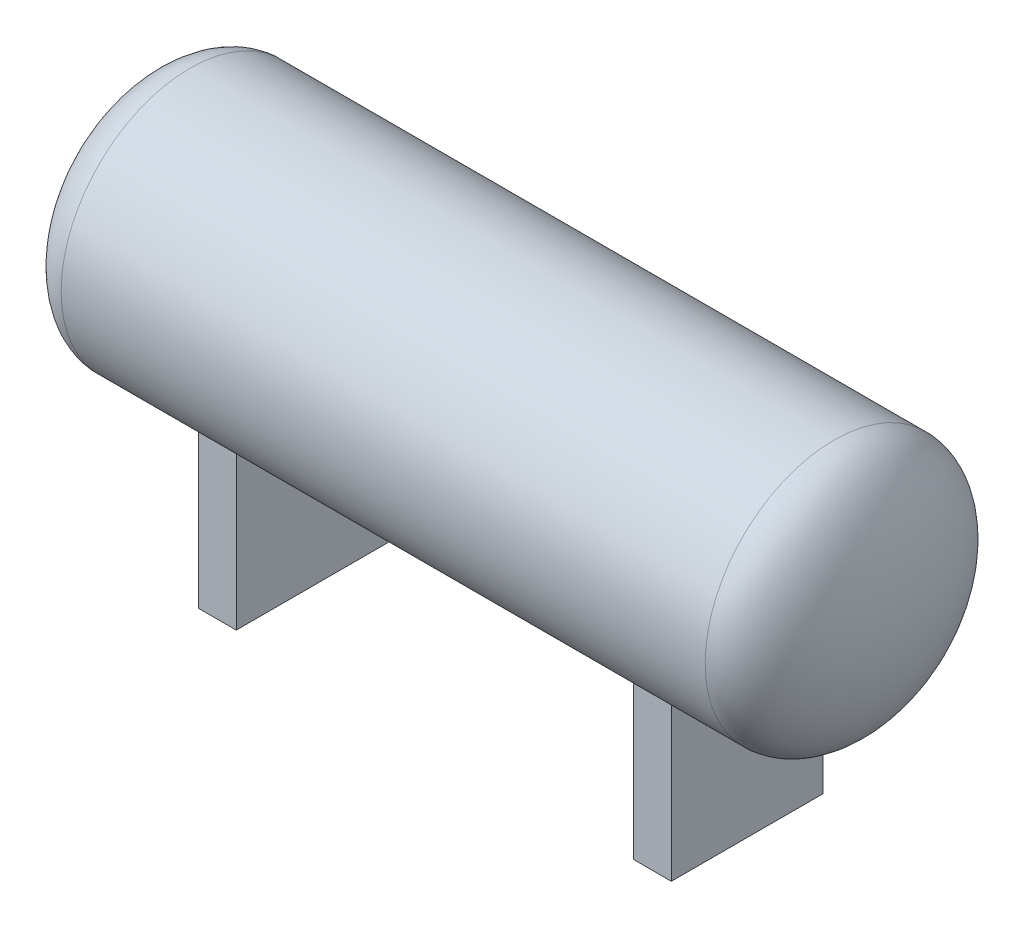
ISO-10303-21;
HEADER;
FILE_DESCRIPTION(('STEP AP214'),'2;1');
FILE_NAME('part.step','',(''),(''),'','','');
FILE_SCHEMA(('AUTOMOTIVE_DESIGN { 1 0 10303 214 1 1 1 1 }'));
ENDSEC;
DATA;
#1=APPLICATION_CONTEXT('core data for automotive mechanical design processes');
#2=APPLICATION_PROTOCOL_DEFINITION('international standard','automotive_design',2000,#1);
#3=PRODUCT_CONTEXT('',#1,'mechanical');
#4=PRODUCT('Part','Part','',(#3));
#5=PRODUCT_RELATED_PRODUCT_CATEGORY('part','',(#4));
#6=PRODUCT_DEFINITION_FORMATION('','',#4);
#7=PRODUCT_DEFINITION_CONTEXT('part definition',#1,'design');
#8=PRODUCT_DEFINITION('design','',#6,#7);
#9=PRODUCT_DEFINITION_SHAPE('','',#8);
#10=(LENGTH_UNIT() NAMED_UNIT(*) SI_UNIT(.MILLI.,.METRE.));
#11=(NAMED_UNIT(*) PLANE_ANGLE_UNIT() SI_UNIT($,.RADIAN.));
#12=(NAMED_UNIT(*) SI_UNIT($,.STERADIAN.) SOLID_ANGLE_UNIT());
#13=UNCERTAINTY_MEASURE_WITH_UNIT(LENGTH_MEASURE(1.E-05),#10,'distance_accuracy_value','');
#14=(GEOMETRIC_REPRESENTATION_CONTEXT(3) GLOBAL_UNCERTAINTY_ASSIGNED_CONTEXT((#13)) GLOBAL_UNIT_ASSIGNED_CONTEXT((#10,
#11,#12)) REPRESENTATION_CONTEXT('',''));
#15=CARTESIAN_POINT('',(0.,0.,0.));
#16=DIRECTION('',(0.,0.,1.));
#17=DIRECTION('',(1.,0.,0.));
#18=AXIS2_PLACEMENT_3D('',#15,#16,#17);
#19=CARTESIAN_POINT('',(5000.,8.88178419700125E-13,0.));
#20=DIRECTION('',(0.,0.,-1.));
#21=DIRECTION('',(0.,-1.,0.));
#22=AXIS2_PLACEMENT_3D('',#19,#20,#21);
#23=ELLIPSE('',#22,2000.,1000.);
#24=TRIMMED_CURVE('',#23,(PARAMETER_VALUE(4.71238898038469)),
(PARAMETER_VALUE(7.85398163397448)),.T.,.PARAMETER.);
#25=CARTESIAN_POINT('',(4000.,8.88178419700125E-13,0.));
#26=DIRECTION('',(1.,0.,0.));
#27=AXIS1_PLACEMENT('',#25,#26);
#28=SURFACE_OF_REVOLUTION('',#24,#27);
#29=CARTESIAN_POINT('',(6000.,8.88178419700125E-13,0.));
#30=VERTEX_POINT('',#29);
#31=VERTEX_LOOP('',#30);
#32=FACE_BOUND('',#31,.T.);
#33=CARTESIAN_POINT('',(5000.,8.88178419700125E-13,0.));
#34=DIRECTION('',(-1.,0.,0.));
#35=DIRECTION('',(0.,-1.,0.));
#36=AXIS2_PLACEMENT_3D('',#33,#34,#35);
#37=CIRCLE('',#36,2000.);
#38=CARTESIAN_POINT('',(5000.,-2000.,0.));
#39=VERTEX_POINT('',#38);
#40=EDGE_CURVE('E154',#39,#39,#37,.T.);
#41=ORIENTED_EDGE('',*,*,#40,.F.);
#42=EDGE_LOOP('',(#41));
#43=FACE_BOUND('',#42,.T.);
#44=ADVANCED_FACE('F30',(#32,#43),#28,.F.);
#45=CARTESIAN_POINT('',(-4927.31665531561,-8.88178419700125E-13,0.));
#46=DIRECTION('',(-1.,0.,0.));
#47=DIRECTION('',(0.,-1.,0.));
#48=AXIS2_PLACEMENT_3D('',#45,#46,#47);
#49=CYLINDRICAL_SURFACE('',#48,2000.);
#50=CARTESIAN_POINT('',(-3084.8333836706,0.,0.));
#51=DIRECTION('',(1.,0.,0.));
#52=DIRECTION('',(0.,0.,-1.));
#53=AXIS2_PLACEMENT_3D('',#50,#51,#52);
#54=CIRCLE('',#53,2000.);
#55=CARTESIAN_POINT('',(-3084.8333836706,-1602.56524695724,1196.57203261854));
#56=VERTEX_POINT('',#55);
#57=CARTESIAN_POINT('',(-3084.8333836706,-1631.945015768,-1156.18141548374));
#58=VERTEX_POINT('',#57);
#59=EDGE_CURVE('E39',#56,#58,#54,.T.);
#60=ORIENTED_EDGE('',*,*,#59,.T.);
#61=DIRECTION('',(-1.,0.,0.));
#62=VECTOR('',#61,1.);
#63=CARTESIAN_POINT('',(-4927.31665531561,-1631.945015768,-1156.18141548374));
#64=LINE('',#63,#62);
#65=CARTESIAN_POINT('',(-3670.49733212524,-1631.945015768,-1156.18141548374));
#66=VERTEX_POINT('',#65);
#67=EDGE_CURVE('E11',#58,#66,#64,.T.);
#68=ORIENTED_EDGE('',*,*,#67,.T.);
#69=CARTESIAN_POINT('',(-3670.49733212524,-8.88178419700125E-13,0.));
#70=DIRECTION('',(-1.,0.,0.));
#71=DIRECTION('',(0.,0.,1.));
#72=AXIS2_PLACEMENT_3D('',#69,#70,#71);
#73=CIRCLE('',#72,2000.);
#74=CARTESIAN_POINT('',(-3670.49733212524,-1602.56524695724,1196.57203261854));
#75=VERTEX_POINT('',#74);
#76=EDGE_CURVE('E105',#66,#75,#73,.T.);
#77=ORIENTED_EDGE('',*,*,#76,.T.);
#78=DIRECTION('',(-1.,0.,0.));
#79=VECTOR('',#78,1.);
#80=CARTESIAN_POINT('',(-4927.31665531561,-1602.56524695724,1196.57203261854));
#81=LINE('',#80,#79);
#82=EDGE_CURVE('E288',#75,#56,#81,.F.);
#83=ORIENTED_EDGE('',*,*,#82,.T.);
#84=EDGE_LOOP('',(#60,#68,#77,#83));
#85=FACE_BOUND('',#84,.T.);
#86=DIRECTION('',(-1.,0.,0.));
#87=VECTOR('',#86,1.);
#88=CARTESIAN_POINT('',(-4927.31665531561,-1631.945015768,-1156.18141548374));
#89=LINE('',#88,#87);
#90=CARTESIAN_POINT('',(3670.49733212524,-1631.945015768,-1156.18141548374));
#91=VERTEX_POINT('',#90);
#92=CARTESIAN_POINT('',(3084.8333836706,-1631.945015768,-1156.18141548374));
#93=VERTEX_POINT('',#92);
#94=EDGE_CURVE('E296',#91,#93,#89,.T.);
#95=ORIENTED_EDGE('',*,*,#94,.T.);
#96=CARTESIAN_POINT('',(3084.8333836706,0.,0.));
#97=DIRECTION('',(-1.,0.,0.));
#98=DIRECTION('',(0.,0.,1.));
#99=AXIS2_PLACEMENT_3D('',#96,#97,#98);
#100=CIRCLE('',#99,2000.);
#101=CARTESIAN_POINT('',(3084.8333836706,-1602.56524695724,1196.57203261854));
#102=VERTEX_POINT('',#101);
#103=EDGE_CURVE('E291',#93,#102,#100,.T.);
#104=ORIENTED_EDGE('',*,*,#103,.T.);
#105=DIRECTION('',(-1.,0.,0.));
#106=VECTOR('',#105,1.);
#107=CARTESIAN_POINT('',(-4927.31665531561,-1602.56524695724,1196.57203261854));
#108=LINE('',#107,#106);
#109=CARTESIAN_POINT('',(3670.49733212524,-1602.56524695724,1196.57203261854));
#110=VERTEX_POINT('',#109);
#111=EDGE_CURVE('E157',#102,#110,#108,.F.);
#112=ORIENTED_EDGE('',*,*,#111,.T.);
#113=CARTESIAN_POINT('',(3670.49733212524,8.88178419700125E-13,0.));
#114=DIRECTION('',(1.,0.,0.));
#115=DIRECTION('',(0.,0.,-1.));
#116=AXIS2_PLACEMENT_3D('',#113,#114,#115);
#117=CIRCLE('',#116,2000.);
#118=EDGE_CURVE('E299',#110,#91,#117,.T.);
#119=ORIENTED_EDGE('',*,*,#118,.T.);
#120=EDGE_LOOP('',(#95,#104,#112,#119));
#121=FACE_BOUND('',#120,.T.);
#122=CARTESIAN_POINT('',(-5000.,-8.88178419700125E-13,0.));
#123=DIRECTION('',(-1.,0.,0.));
#124=DIRECTION('',(0.,-1.,0.));
#125=AXIS2_PLACEMENT_3D('',#122,#123,#124);
#126=CIRCLE('',#125,2000.);
#127=CARTESIAN_POINT('',(-5000.,-2000.,0.));
#128=VERTEX_POINT('',#127);
#129=EDGE_CURVE('E147',#128,#128,#126,.T.);
#130=ORIENTED_EDGE('',*,*,#129,.F.);
#131=EDGE_LOOP('',(#130));
#132=FACE_BOUND('',#131,.T.);
#133=ORIENTED_EDGE('',*,*,#40,.T.);
#134=EDGE_LOOP('',(#133));
#135=FACE_BOUND('',#134,.T.);
#136=ADVANCED_FACE('F162',(#85,#121,#132,#135),#49,.T.);
#137=CARTESIAN_POINT('',(-5000.,-8.88178419700125E-13,0.));
#138=DIRECTION('',(0.,0.,1.));
#139=DIRECTION('',(0.,-1.,0.));
#140=AXIS2_PLACEMENT_3D('',#137,#138,#139);
#141=ELLIPSE('',#140,2000.,999.999999999999);
#142=TRIMMED_CURVE('',#141,(PARAMETER_VALUE(4.71238898038469)),
(PARAMETER_VALUE(7.85398163397448)),.T.,.PARAMETER.);
#143=CARTESIAN_POINT('',(-4000.,-8.88178419700125E-13,0.));
#144=DIRECTION('',(-1.,0.,0.));
#145=AXIS1_PLACEMENT('',#143,#144);
#146=SURFACE_OF_REVOLUTION('',#142,#145);
#147=CARTESIAN_POINT('',(-6000.,0.,0.));
#148=VERTEX_POINT('',#147);
#149=VERTEX_LOOP('',#148);
#150=FACE_BOUND('',#149,.T.);
#151=ORIENTED_EDGE('',*,*,#129,.T.);
#152=EDGE_LOOP('',(#151));
#153=FACE_BOUND('',#152,.T.);
#154=ADVANCED_FACE('F32',(#150,#153),#146,.F.);
#155=CARTESIAN_POINT('',(3084.8333836706,-4000.,-1156.18141548374));
#156=DIRECTION('',(-1.,0.,0.));
#157=DIRECTION('',(0.,0.,1.));
#158=AXIS2_PLACEMENT_3D('',#155,#156,#157);
#159=PLANE('',#158);
#160=ORIENTED_EDGE('',*,*,#103,.F.);
#161=DIRECTION('',(0.,1.,0.));
#162=VECTOR('',#161,1.);
#163=CARTESIAN_POINT('',(3084.8333836706,-4000.,-1156.18141548374));
#164=LINE('',#163,#162);
#165=CARTESIAN_POINT('',(3084.8333836706,-4000.,-1156.18141548374));
#166=VERTEX_POINT('',#165);
#167=EDGE_CURVE('E144',#166,#93,#164,.T.);
#168=ORIENTED_EDGE('',*,*,#167,.F.);
#169=DIRECTION('',(0.,0.,1.));
#170=VECTOR('',#169,1.);
#171=CARTESIAN_POINT('',(3084.8333836706,-4000.,-1156.18141548374));
#172=LINE('',#171,#170);
#173=CARTESIAN_POINT('',(3084.8333836706,-4000.,1196.57203261854));
#174=VERTEX_POINT('',#173);
#175=EDGE_CURVE('E128',#166,#174,#172,.T.);
#176=ORIENTED_EDGE('',*,*,#175,.T.);
#177=DIRECTION('',(0.,1.,0.));
#178=VECTOR('',#177,1.);
#179=CARTESIAN_POINT('',(3084.8333836706,-4000.,1196.57203261854));
#180=LINE('',#179,#178);
#181=EDGE_CURVE('E143',#174,#102,#180,.T.);
#182=ORIENTED_EDGE('',*,*,#181,.T.);
#183=EDGE_LOOP('',(#160,#168,#176,#182));
#184=FACE_BOUND('',#183,.T.);
#185=ADVANCED_FACE('F167',(#184),#159,.T.);
#186=CARTESIAN_POINT('',(3084.8333836706,-4000.,-1156.18141548374));
#187=DIRECTION('',(0.,0.,-1.));
#188=DIRECTION('',(-1.,0.,0.));
#189=AXIS2_PLACEMENT_3D('',#186,#187,#188);
#190=PLANE('',#189);
#191=ORIENTED_EDGE('',*,*,#94,.F.);
#192=DIRECTION('',(0.,1.,0.));
#193=VECTOR('',#192,1.);
#194=CARTESIAN_POINT('',(3670.49733212524,-4000.,-1156.18141548374));
#195=LINE('',#194,#193);
#196=CARTESIAN_POINT('',(3670.49733212524,-4000.,-1156.18141548374));
#197=VERTEX_POINT('',#196);
#198=EDGE_CURVE('E148',#197,#91,#195,.T.);
#199=ORIENTED_EDGE('',*,*,#198,.F.);
#200=DIRECTION('',(-1.,0.,0.));
#201=VECTOR('',#200,1.);
#202=CARTESIAN_POINT('',(3084.8333836706,-4000.,-1156.18141548374));
#203=LINE('',#202,#201);
#204=EDGE_CURVE('E140',#197,#166,#203,.T.);
#205=ORIENTED_EDGE('',*,*,#204,.T.);
#206=ORIENTED_EDGE('',*,*,#167,.T.);
#207=EDGE_LOOP('',(#191,#199,#205,#206));
#208=FACE_BOUND('',#207,.T.);
#209=ADVANCED_FACE('F170',(#208),#190,.T.);
#210=CARTESIAN_POINT('',(3670.49733212524,-4000.,-1156.18141548374));
#211=DIRECTION('',(1.,0.,0.));
#212=DIRECTION('',(0.,0.,-1.));
#213=AXIS2_PLACEMENT_3D('',#210,#211,#212);
#214=PLANE('',#213);
#215=ORIENTED_EDGE('',*,*,#118,.F.);
#216=DIRECTION('',(0.,1.,0.));
#217=VECTOR('',#216,1.);
#218=CARTESIAN_POINT('',(3670.49733212524,-4000.,1196.57203261854));
#219=LINE('',#218,#217);
#220=CARTESIAN_POINT('',(3670.49733212524,-4000.,1196.57203261854));
#221=VERTEX_POINT('',#220);
#222=EDGE_CURVE('E54',#221,#110,#219,.T.);
#223=ORIENTED_EDGE('',*,*,#222,.F.);
#224=DIRECTION('',(0.,0.,-1.));
#225=VECTOR('',#224,1.);
#226=CARTESIAN_POINT('',(3670.49733212524,-4000.,-1156.18141548374));
#227=LINE('',#226,#225);
#228=EDGE_CURVE('E137',#221,#197,#227,.T.);
#229=ORIENTED_EDGE('',*,*,#228,.T.);
#230=ORIENTED_EDGE('',*,*,#198,.T.);
#231=EDGE_LOOP('',(#215,#223,#229,#230));
#232=FACE_BOUND('',#231,.T.);
#233=ADVANCED_FACE('F176',(#232),#214,.T.);
#234=CARTESIAN_POINT('',(3084.8333836706,-4000.,1196.57203261854));
#235=DIRECTION('',(0.,0.,1.));
#236=DIRECTION('',(1.,0.,0.));
#237=AXIS2_PLACEMENT_3D('',#234,#235,#236);
#238=PLANE('',#237);
#239=ORIENTED_EDGE('',*,*,#111,.F.);
#240=ORIENTED_EDGE('',*,*,#181,.F.);
#241=DIRECTION('',(1.,0.,0.));
#242=VECTOR('',#241,1.);
#243=CARTESIAN_POINT('',(3084.8333836706,-4000.,1196.57203261854));
#244=LINE('',#243,#242);
#245=EDGE_CURVE('E135',#174,#221,#244,.T.);
#246=ORIENTED_EDGE('',*,*,#245,.T.);
#247=ORIENTED_EDGE('',*,*,#222,.T.);
#248=EDGE_LOOP('',(#239,#240,#246,#247));
#249=FACE_BOUND('',#248,.T.);
#250=ADVANCED_FACE('F172',(#249),#238,.T.);
#251=CARTESIAN_POINT('',(3084.8333836706,-4000.,1196.57203261854));
#252=DIRECTION('',(0.,1.,0.));
#253=DIRECTION('',(0.,0.,1.));
#254=AXIS2_PLACEMENT_3D('',#251,#252,#253);
#255=PLANE('',#254);
#256=ORIENTED_EDGE('',*,*,#175,.F.);
#257=ORIENTED_EDGE('',*,*,#204,.F.);
#258=ORIENTED_EDGE('',*,*,#228,.F.);
#259=ORIENTED_EDGE('',*,*,#245,.F.);
#260=EDGE_LOOP('',(#256,#257,#258,#259));
#261=FACE_BOUND('',#260,.T.);
#262=ADVANCED_FACE('F175',(#261),#255,.F.);
#263=CARTESIAN_POINT('',(-3084.8333836706,-4000.,-1156.18141548374));
#264=DIRECTION('',(0.,0.,-1.));
#265=DIRECTION('',(-1.,0.,0.));
#266=AXIS2_PLACEMENT_3D('',#263,#264,#265);
#267=PLANE('',#266);
#268=ORIENTED_EDGE('',*,*,#67,.F.);
#269=DIRECTION('',(0.,1.,0.));
#270=VECTOR('',#269,1.);
#271=CARTESIAN_POINT('',(-3084.8333836706,-4000.,-1156.18141548374));
#272=LINE('',#271,#270);
#273=CARTESIAN_POINT('',(-3084.8333836706,-4000.,-1156.18141548374));
#274=VERTEX_POINT('',#273);
#275=EDGE_CURVE('E122',#274,#58,#272,.T.);
#276=ORIENTED_EDGE('',*,*,#275,.F.);
#277=DIRECTION('',(-1.,0.,0.));
#278=VECTOR('',#277,1.);
#279=CARTESIAN_POINT('',(-3084.8333836706,-4000.,-1156.18141548374));
#280=LINE('',#279,#278);
#281=CARTESIAN_POINT('',(-3670.49733212524,-4000.,-1156.18141548374));
#282=VERTEX_POINT('',#281);
#283=EDGE_CURVE('E115',#274,#282,#280,.T.);
#284=ORIENTED_EDGE('',*,*,#283,.T.);
#285=DIRECTION('',(0.,1.,0.));
#286=VECTOR('',#285,1.);
#287=CARTESIAN_POINT('',(-3670.49733212524,-4000.,-1156.18141548374));
#288=LINE('',#287,#286);
#289=EDGE_CURVE('E100',#282,#66,#288,.T.);
#290=ORIENTED_EDGE('',*,*,#289,.T.);
#291=EDGE_LOOP('',(#268,#276,#284,#290));
#292=FACE_BOUND('',#291,.T.);
#293=ADVANCED_FACE('F120',(#292),#267,.T.);
#294=CARTESIAN_POINT('',(-3084.8333836706,-4000.,-1156.18141548374));
#295=DIRECTION('',(1.,0.,0.));
#296=DIRECTION('',(0.,0.,-1.));
#297=AXIS2_PLACEMENT_3D('',#294,#295,#296);
#298=PLANE('',#297);
#299=ORIENTED_EDGE('',*,*,#59,.F.);
#300=DIRECTION('',(0.,1.,0.));
#301=VECTOR('',#300,1.);
#302=CARTESIAN_POINT('',(-3084.8333836706,-4000.,1196.57203261854));
#303=LINE('',#302,#301);
#304=CARTESIAN_POINT('',(-3084.8333836706,-4000.,1196.57203261854));
#305=VERTEX_POINT('',#304);
#306=EDGE_CURVE('E129',#305,#56,#303,.T.);
#307=ORIENTED_EDGE('',*,*,#306,.F.);
#308=DIRECTION('',(0.,0.,-1.));
#309=VECTOR('',#308,1.);
#310=CARTESIAN_POINT('',(-3084.8333836706,-4000.,-1156.18141548374));
#311=LINE('',#310,#309);
#312=EDGE_CURVE('E108',#305,#274,#311,.T.);
#313=ORIENTED_EDGE('',*,*,#312,.T.);
#314=ORIENTED_EDGE('',*,*,#275,.T.);
#315=EDGE_LOOP('',(#299,#307,#313,#314));
#316=FACE_BOUND('',#315,.T.);
#317=ADVANCED_FACE('F188',(#316),#298,.T.);
#318=CARTESIAN_POINT('',(-3084.8333836706,-4000.,1196.57203261854));
#319=DIRECTION('',(0.,0.,1.));
#320=DIRECTION('',(1.,0.,0.));
#321=AXIS2_PLACEMENT_3D('',#318,#319,#320);
#322=PLANE('',#321);
#323=ORIENTED_EDGE('',*,*,#82,.F.);
#324=DIRECTION('',(0.,1.,0.));
#325=VECTOR('',#324,1.);
#326=CARTESIAN_POINT('',(-3670.49733212524,-4000.,1196.57203261854));
#327=LINE('',#326,#325);
#328=CARTESIAN_POINT('',(-3670.49733212524,-4000.,1196.57203261854));
#329=VERTEX_POINT('',#328);
#330=EDGE_CURVE('E46',#329,#75,#327,.T.);
#331=ORIENTED_EDGE('',*,*,#330,.F.);
#332=DIRECTION('',(1.,0.,0.));
#333=VECTOR('',#332,1.);
#334=CARTESIAN_POINT('',(-3084.8333836706,-4000.,1196.57203261854));
#335=LINE('',#334,#333);
#336=EDGE_CURVE('E118',#329,#305,#335,.T.);
#337=ORIENTED_EDGE('',*,*,#336,.T.);
#338=ORIENTED_EDGE('',*,*,#306,.T.);
#339=EDGE_LOOP('',(#323,#331,#337,#338));
#340=FACE_BOUND('',#339,.T.);
#341=ADVANCED_FACE('F191',(#340),#322,.T.);
#342=CARTESIAN_POINT('',(-3670.49733212524,-4000.,-1156.18141548374));
#343=DIRECTION('',(-1.,0.,0.));
#344=DIRECTION('',(0.,0.,1.));
#345=AXIS2_PLACEMENT_3D('',#342,#343,#344);
#346=PLANE('',#345);
#347=ORIENTED_EDGE('',*,*,#76,.F.);
#348=ORIENTED_EDGE('',*,*,#289,.F.);
#349=DIRECTION('',(0.,0.,1.));
#350=VECTOR('',#349,1.);
#351=CARTESIAN_POINT('',(-3670.49733212524,-4000.,-1156.18141548374));
#352=LINE('',#351,#350);
#353=EDGE_CURVE('E103',#282,#329,#352,.T.);
#354=ORIENTED_EDGE('',*,*,#353,.T.);
#355=ORIENTED_EDGE('',*,*,#330,.T.);
#356=EDGE_LOOP('',(#347,#348,#354,#355));
#357=FACE_BOUND('',#356,.T.);
#358=ADVANCED_FACE('F102',(#357),#346,.T.);
#359=CARTESIAN_POINT('',(-3670.49733212524,-4000.,-1156.18141548374));
#360=DIRECTION('',(0.,1.,0.));
#361=DIRECTION('',(0.,0.,1.));
#362=AXIS2_PLACEMENT_3D('',#359,#360,#361);
#363=PLANE('',#362);
#364=ORIENTED_EDGE('',*,*,#283,.F.);
#365=ORIENTED_EDGE('',*,*,#312,.F.);
#366=ORIENTED_EDGE('',*,*,#336,.F.);
#367=ORIENTED_EDGE('',*,*,#353,.F.);
#368=EDGE_LOOP('',(#364,#365,#366,#367));
#369=FACE_BOUND('',#368,.T.);
#370=ADVANCED_FACE('F113',(#369),#363,.F.);
#371=CLOSED_SHELL('',(#44,#136,#154,#185,#209,#233,#250,#262,#293,#317,#341,#358,#370));
#372=MANIFOLD_SOLID_BREP('B2',#371);
#373=ADVANCED_BREP_SHAPE_REPRESENTATION('',(#18,#372),#14);
#374=SHAPE_DEFINITION_REPRESENTATION(#9,#373);
ENDSEC;
END-ISO-10303-21;
